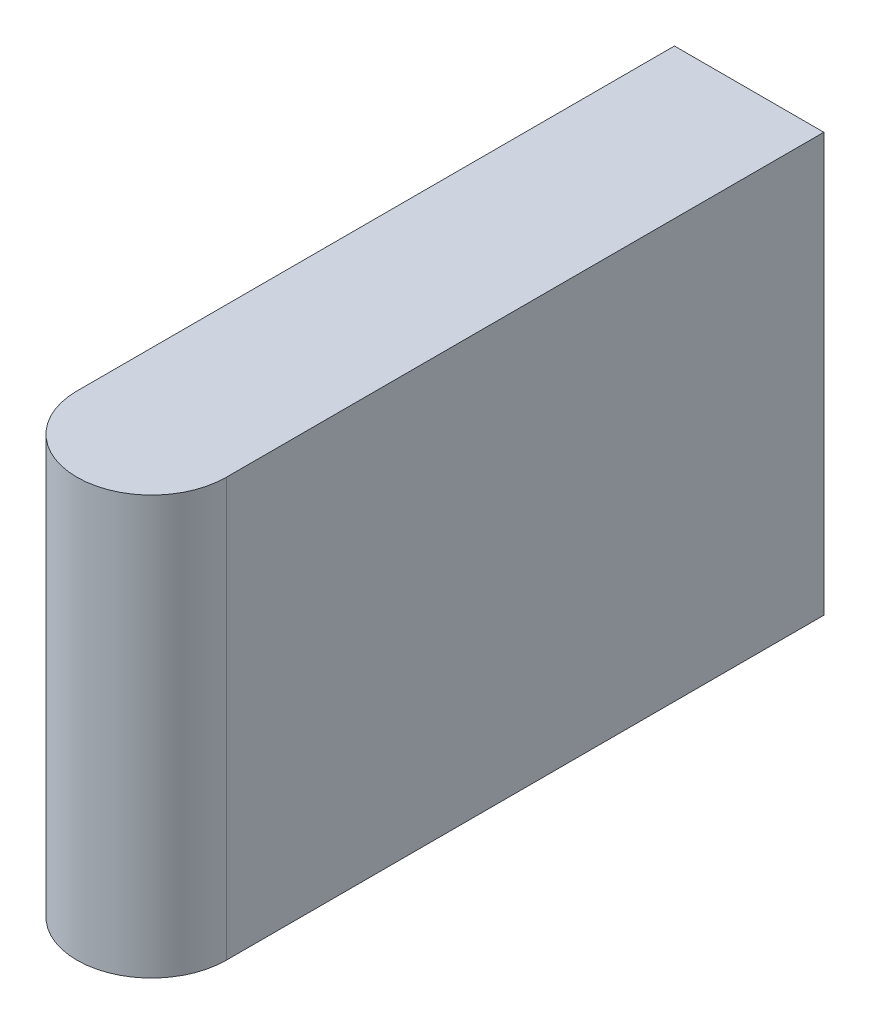
ISO-10303-21;
HEADER;
FILE_DESCRIPTION(('STEP AP214'),'2;1');
FILE_NAME('part.step','',(''),(''),'','','');
FILE_SCHEMA(('AUTOMOTIVE_DESIGN { 1 0 10303 214 1 1 1 1 }'));
ENDSEC;
DATA;
#1=APPLICATION_CONTEXT('core data for automotive mechanical design processes');
#2=APPLICATION_PROTOCOL_DEFINITION('international standard','automotive_design',2000,#1);
#3=PRODUCT_CONTEXT('',#1,'mechanical');
#4=PRODUCT('Part','Part','',(#3));
#5=PRODUCT_RELATED_PRODUCT_CATEGORY('part','',(#4));
#6=PRODUCT_DEFINITION_FORMATION('','',#4);
#7=PRODUCT_DEFINITION_CONTEXT('part definition',#1,'design');
#8=PRODUCT_DEFINITION('design','',#6,#7);
#9=PRODUCT_DEFINITION_SHAPE('','',#8);
#10=(LENGTH_UNIT() NAMED_UNIT(*) SI_UNIT(.MILLI.,.METRE.));
#11=(NAMED_UNIT(*) PLANE_ANGLE_UNIT() SI_UNIT($,.RADIAN.));
#12=(NAMED_UNIT(*) SI_UNIT($,.STERADIAN.) SOLID_ANGLE_UNIT());
#13=UNCERTAINTY_MEASURE_WITH_UNIT(LENGTH_MEASURE(1.E-05),#10,'distance_accuracy_value','');
#14=(GEOMETRIC_REPRESENTATION_CONTEXT(3) GLOBAL_UNCERTAINTY_ASSIGNED_CONTEXT((#13)) GLOBAL_UNIT_ASSIGNED_CONTEXT((#10,
#11,#12)) REPRESENTATION_CONTEXT('',''));
#15=CARTESIAN_POINT('',(0.,0.,0.));
#16=DIRECTION('',(0.,0.,1.));
#17=DIRECTION('',(1.,0.,0.));
#18=AXIS2_PLACEMENT_3D('',#15,#16,#17);
#19=CARTESIAN_POINT('',(-0.499999999999999,1.4,0.));
#20=DIRECTION('',(0.,0.,1.));
#21=DIRECTION('',(1.,0.,0.));
#22=AXIS2_PLACEMENT_3D('',#19,#20,#21);
#23=PLANE('',#22);
#24=DIRECTION('',(-1.,0.,0.));
#25=VECTOR('',#24,1.);
#26=CARTESIAN_POINT('',(-0.499999999999999,-1.4,0.));
#27=LINE('',#26,#25);
#28=CARTESIAN_POINT('',(0.500000000000002,-1.4,0.));
#29=VERTEX_POINT('',#28);
#30=CARTESIAN_POINT('',(-0.499999999999999,-1.4,0.));
#31=VERTEX_POINT('',#30);
#32=EDGE_CURVE('E79',#29,#31,#27,.T.);
#33=ORIENTED_EDGE('',*,*,#32,.T.);
#34=DIRECTION('',(0.,-1.,0.));
#35=VECTOR('',#34,1.);
#36=CARTESIAN_POINT('',(-0.499999999999999,1.4,0.));
#37=LINE('',#36,#35);
#38=CARTESIAN_POINT('',(-0.499999999999999,1.4,0.));
#39=VERTEX_POINT('',#38);
#40=EDGE_CURVE('E11',#39,#31,#37,.T.);
#41=ORIENTED_EDGE('',*,*,#40,.F.);
#42=DIRECTION('',(-1.,0.,0.));
#43=VECTOR('',#42,1.);
#44=CARTESIAN_POINT('',(-0.499999999999999,1.4,0.));
#45=LINE('',#44,#43);
#46=CARTESIAN_POINT('',(0.500000000000002,1.4,0.));
#47=VERTEX_POINT('',#46);
#48=EDGE_CURVE('E97',#47,#39,#45,.T.);
#49=ORIENTED_EDGE('',*,*,#48,.F.);
#50=DIRECTION('',(0.,-1.,0.));
#51=VECTOR('',#50,1.);
#52=CARTESIAN_POINT('',(0.500000000000002,1.4,0.));
#53=LINE('',#52,#51);
#54=EDGE_CURVE('E91',#47,#29,#53,.T.);
#55=ORIENTED_EDGE('',*,*,#54,.T.);
#56=EDGE_LOOP('',(#33,#41,#49,#55));
#57=FACE_BOUND('',#56,.T.);
#58=ADVANCED_FACE('F35',(#57),#23,.F.);
#59=CARTESIAN_POINT('',(-0.499999999999999,1.4,0.));
#60=DIRECTION('',(1.,0.,0.));
#61=DIRECTION('',(0.,0.,-1.));
#62=AXIS2_PLACEMENT_3D('',#59,#60,#61);
#63=PLANE('',#62);
#64=DIRECTION('',(0.,0.,1.));
#65=VECTOR('',#64,1.);
#66=CARTESIAN_POINT('',(-0.499999999999999,-1.4,0.));
#67=LINE('',#66,#65);
#68=CARTESIAN_POINT('',(-0.5,-1.4,4.));
#69=VERTEX_POINT('',#68);
#70=EDGE_CURVE('E75',#31,#69,#67,.T.);
#71=ORIENTED_EDGE('',*,*,#70,.T.);
#72=DIRECTION('',(0.,-1.,0.));
#73=VECTOR('',#72,1.);
#74=CARTESIAN_POINT('',(-0.5,1.4,4.));
#75=LINE('',#74,#73);
#76=CARTESIAN_POINT('',(-0.5,1.4,4.));
#77=VERTEX_POINT('',#76);
#78=EDGE_CURVE('E42',#77,#69,#75,.T.);
#79=ORIENTED_EDGE('',*,*,#78,.F.);
#80=DIRECTION('',(0.,0.,1.));
#81=VECTOR('',#80,1.);
#82=CARTESIAN_POINT('',(-0.499999999999999,1.4,0.));
#83=LINE('',#82,#81);
#84=EDGE_CURVE('E87',#39,#77,#83,.T.);
#85=ORIENTED_EDGE('',*,*,#84,.F.);
#86=ORIENTED_EDGE('',*,*,#40,.T.);
#87=EDGE_LOOP('',(#71,#79,#85,#86));
#88=FACE_BOUND('',#87,.T.);
#89=ADVANCED_FACE('F86',(#88),#63,.F.);
#90=CARTESIAN_POINT('',(0.,1.4,4.));
#91=DIRECTION('',(0.,-1.,0.));
#92=DIRECTION('',(0.,0.,-1.));
#93=AXIS2_PLACEMENT_3D('',#90,#91,#92);
#94=CYLINDRICAL_SURFACE('',#93,0.5);
#95=CARTESIAN_POINT('',(0.,-1.4,4.));
#96=DIRECTION('',(0.,1.,0.));
#97=DIRECTION('',(0.,0.,1.));
#98=AXIS2_PLACEMENT_3D('',#95,#96,#97);
#99=CIRCLE('',#98,0.5);
#100=CARTESIAN_POINT('',(0.500000000000001,-1.4,4.));
#101=VERTEX_POINT('',#100);
#102=EDGE_CURVE('E80',#69,#101,#99,.T.);
#103=ORIENTED_EDGE('',*,*,#102,.T.);
#104=DIRECTION('',(0.,-1.,0.));
#105=VECTOR('',#104,1.);
#106=CARTESIAN_POINT('',(0.500000000000001,1.4,4.));
#107=LINE('',#106,#105);
#108=CARTESIAN_POINT('',(0.500000000000001,1.4,4.));
#109=VERTEX_POINT('',#108);
#110=EDGE_CURVE('E103',#109,#101,#107,.T.);
#111=ORIENTED_EDGE('',*,*,#110,.F.);
#112=CARTESIAN_POINT('',(0.,1.4,4.));
#113=DIRECTION('',(0.,1.,0.));
#114=DIRECTION('',(0.,0.,1.));
#115=AXIS2_PLACEMENT_3D('',#112,#113,#114);
#116=CIRCLE('',#115,0.5);
#117=EDGE_CURVE('E54',#77,#109,#116,.T.);
#118=ORIENTED_EDGE('',*,*,#117,.F.);
#119=ORIENTED_EDGE('',*,*,#78,.T.);
#120=EDGE_LOOP('',(#103,#111,#118,#119));
#121=FACE_BOUND('',#120,.T.);
#122=ADVANCED_FACE('F106',(#121),#94,.T.);
#123=CARTESIAN_POINT('',(0.500000000000002,1.4,0.));
#124=DIRECTION('',(-1.,0.,0.));
#125=DIRECTION('',(0.,0.,1.));
#126=AXIS2_PLACEMENT_3D('',#123,#124,#125);
#127=PLANE('',#126);
#128=DIRECTION('',(0.,0.,-1.));
#129=VECTOR('',#128,1.);
#130=CARTESIAN_POINT('',(0.500000000000002,-1.4,0.));
#131=LINE('',#130,#129);
#132=EDGE_CURVE('E95',#101,#29,#131,.T.);
#133=ORIENTED_EDGE('',*,*,#132,.T.);
#134=ORIENTED_EDGE('',*,*,#54,.F.);
#135=DIRECTION('',(0.,0.,-1.));
#136=VECTOR('',#135,1.);
#137=CARTESIAN_POINT('',(0.500000000000002,1.4,0.));
#138=LINE('',#137,#136);
#139=EDGE_CURVE('E49',#109,#47,#138,.T.);
#140=ORIENTED_EDGE('',*,*,#139,.F.);
#141=ORIENTED_EDGE('',*,*,#110,.T.);
#142=EDGE_LOOP('',(#133,#134,#140,#141));
#143=FACE_BOUND('',#142,.T.);
#144=ADVANCED_FACE('F108',(#143),#127,.F.);
#145=CARTESIAN_POINT('',(0.,1.4,4.));
#146=DIRECTION('',(0.,1.,0.));
#147=DIRECTION('',(0.,0.,1.));
#148=AXIS2_PLACEMENT_3D('',#145,#146,#147);
#149=PLANE('',#148);
#150=ORIENTED_EDGE('',*,*,#48,.T.);
#151=ORIENTED_EDGE('',*,*,#84,.T.);
#152=ORIENTED_EDGE('',*,*,#117,.T.);
#153=ORIENTED_EDGE('',*,*,#139,.T.);
#154=EDGE_LOOP('',(#150,#151,#152,#153));
#155=FACE_BOUND('',#154,.T.);
#156=ADVANCED_FACE('F109',(#155),#149,.T.);
#157=CARTESIAN_POINT('',(0.,-1.4,4.));
#158=DIRECTION('',(0.,1.,0.));
#159=DIRECTION('',(0.,0.,1.));
#160=AXIS2_PLACEMENT_3D('',#157,#158,#159);
#161=PLANE('',#160);
#162=ORIENTED_EDGE('',*,*,#32,.F.);
#163=ORIENTED_EDGE('',*,*,#132,.F.);
#164=ORIENTED_EDGE('',*,*,#102,.F.);
#165=ORIENTED_EDGE('',*,*,#70,.F.);
#166=EDGE_LOOP('',(#162,#163,#164,#165));
#167=FACE_BOUND('',#166,.T.);
#168=ADVANCED_FACE('F76',(#167),#161,.F.);
#169=CLOSED_SHELL('',(#58,#89,#122,#144,#156,#168));
#170=MANIFOLD_SOLID_BREP('B2',#169);
#171=ADVANCED_BREP_SHAPE_REPRESENTATION('',(#18,#170),#14);
#172=SHAPE_DEFINITION_REPRESENTATION(#9,#171);
ENDSEC;
END-ISO-10303-21;
